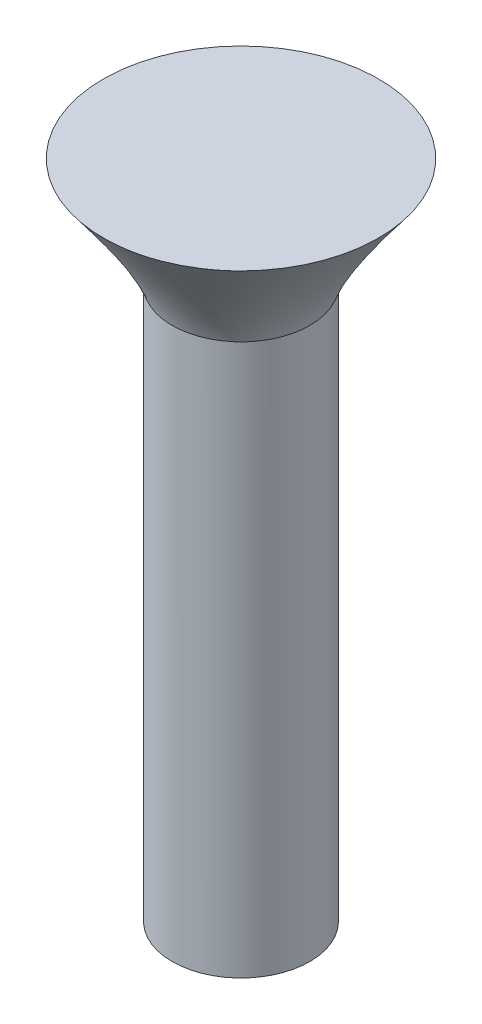
ISO-10303-21;
HEADER;
FILE_DESCRIPTION(('STEP AP214'),'2;1');
FILE_NAME('part.step','',(''),(''),'','','');
FILE_SCHEMA(('AUTOMOTIVE_DESIGN { 1 0 10303 214 1 1 1 1 }'));
ENDSEC;
DATA;
#1=APPLICATION_CONTEXT('core data for automotive mechanical design processes');
#2=APPLICATION_PROTOCOL_DEFINITION('international standard','automotive_design',2000,#1);
#3=PRODUCT_CONTEXT('',#1,'mechanical');
#4=PRODUCT('Part','Part','',(#3));
#5=PRODUCT_RELATED_PRODUCT_CATEGORY('part','',(#4));
#6=PRODUCT_DEFINITION_FORMATION('','',#4);
#7=PRODUCT_DEFINITION_CONTEXT('part definition',#1,'design');
#8=PRODUCT_DEFINITION('design','',#6,#7);
#9=PRODUCT_DEFINITION_SHAPE('','',#8);
#10=(LENGTH_UNIT() NAMED_UNIT(*) SI_UNIT(.MILLI.,.METRE.));
#11=(NAMED_UNIT(*) PLANE_ANGLE_UNIT() SI_UNIT($,.RADIAN.));
#12=(NAMED_UNIT(*) SI_UNIT($,.STERADIAN.) SOLID_ANGLE_UNIT());
#13=UNCERTAINTY_MEASURE_WITH_UNIT(LENGTH_MEASURE(1.E-05),#10,'distance_accuracy_value','');
#14=(GEOMETRIC_REPRESENTATION_CONTEXT(3) GLOBAL_UNCERTAINTY_ASSIGNED_CONTEXT((#13)) GLOBAL_UNIT_ASSIGNED_CONTEXT((#10,
#11,#12)) REPRESENTATION_CONTEXT('',''));
#15=CARTESIAN_POINT('',(0.,0.,0.));
#16=DIRECTION('',(0.,0.,1.));
#17=DIRECTION('',(1.,0.,0.));
#18=AXIS2_PLACEMENT_3D('',#15,#16,#17);
#19=CARTESIAN_POINT('',(0.,20.,0.));
#20=DIRECTION('',(0.,-1.,0.));
#21=DIRECTION('',(0.,0.,-1.));
#22=AXIS2_PLACEMENT_3D('',#19,#20,#21);
#23=CYLINDRICAL_SURFACE('',#22,2.5);
#24=CARTESIAN_POINT('',(0.,20.,0.));
#25=DIRECTION('',(0.,-1.,0.));
#26=DIRECTION('',(0.,0.,-1.));
#27=AXIS2_PLACEMENT_3D('',#24,#25,#26);
#28=CIRCLE('',#27,2.5);
#29=CARTESIAN_POINT('',(-2.27850819158861,20.,-1.02878589651277));
#30=VERTEX_POINT('',#29);
#31=EDGE_CURVE('E11',#30,#30,#28,.F.);
#32=ORIENTED_EDGE('',*,*,#31,.F.);
#33=EDGE_LOOP('',(#32));
#34=FACE_BOUND('',#33,.T.);
#35=CARTESIAN_POINT('',(0.,0.,0.));
#36=DIRECTION('',(0.,1.,0.));
#37=DIRECTION('',(0.,0.,1.));
#38=AXIS2_PLACEMENT_3D('',#35,#36,#37);
#39=CIRCLE('',#38,2.5);
#40=CARTESIAN_POINT('',(0.,0.,2.5));
#41=VERTEX_POINT('',#40);
#42=EDGE_CURVE('E45',#41,#41,#39,.T.);
#43=ORIENTED_EDGE('',*,*,#42,.T.);
#44=EDGE_LOOP('',(#43));
#45=FACE_BOUND('',#44,.T.);
#46=ADVANCED_FACE('F38',(#34,#45),#23,.T.);
#47=CARTESIAN_POINT('',(0.,0.,0.));
#48=DIRECTION('',(0.,1.,0.));
#49=DIRECTION('',(0.,0.,1.));
#50=AXIS2_PLACEMENT_3D('',#47,#48,#49);
#51=PLANE('',#50);
#52=ORIENTED_EDGE('',*,*,#42,.F.);
#53=EDGE_LOOP('',(#52));
#54=FACE_BOUND('',#53,.T.);
#55=ADVANCED_FACE('F71',(#54),#51,.F.);
#56=CARTESIAN_POINT('',(0.,24.000000128,0.));
#57=DIRECTION('',(0.,1.,0.));
#58=DIRECTION('',(0.,0.,1.));
#59=AXIS2_PLACEMENT_3D('',#56,#57,#58);
#60=PLANE('',#59);
#61=CARTESIAN_POINT('',(0.,24.000000128,0.));
#62=DIRECTION('',(0.,1.,0.));
#63=DIRECTION('',(0.,0.,1.));
#64=AXIS2_PLACEMENT_3D('',#61,#62,#63);
#65=CIRCLE('',#64,5.);
#66=CARTESIAN_POINT('',(-2.25314133065137,24.000000128,-4.46355846204691));
#67=VERTEX_POINT('',#66);
#68=EDGE_CURVE('E49',#67,#67,#65,.T.);
#69=ORIENTED_EDGE('',*,*,#68,.T.);
#70=EDGE_LOOP('',(#69));
#71=FACE_BOUND('',#70,.T.);
#72=ADVANCED_FACE('F61',(#71),#60,.T.);
#73=CARTESIAN_POINT('',(-2.27850819158861,20.,-1.02878589651277));
#74=CARTESIAN_POINT('',(-2.25314133065137,24.000000128,-4.46355846204691));
#75=CARTESIAN_POINT('',(-4.33607998461416,20.,3.52823048666445));
#76=CARTESIAN_POINT('',(-11.1802582547452,24.000000128,0.0427241992558202));
#77=CARTESIAN_POINT('',(0.220936398563068,20.,5.58580227969));
#78=CARTESIAN_POINT('',(-6.67397559344245,24.000000128,8.96984112334964));
#79=CARTESIAN_POINT('',(2.27850819158861,20.,1.02878589651277));
#80=CARTESIAN_POINT('',(2.25314133065137,24.000000128,4.46355846204691));
#81=CARTESIAN_POINT('',(4.33607998461416,20.,-3.52823048666445));
#82=CARTESIAN_POINT('',(11.1802582547452,24.000000128,-0.0427241992558211));
#83=CARTESIAN_POINT('',(-0.220936398563068,20.,-5.58580227969));
#84=CARTESIAN_POINT('',(6.67397559344246,24.000000128,-8.96984112334964));
#85=CARTESIAN_POINT('',(-2.27850819158861,20.,-1.02878589651277));
#86=CARTESIAN_POINT('',(-2.25314133065137,24.000000128,-4.46355846204691));
#87=(BOUNDED_SURFACE() B_SPLINE_SURFACE(3,1,((#73,#74),(#75,#76),(#77,#78),(#79,#80),(#81,#82),
(#83,#84),(#85,#86)),.UNSPECIFIED.,.T.,.F.,.F.) B_SPLINE_SURFACE_WITH_KNOTS((4,3,4),(2,2),(0.,
0.5,1.),(0.,1.),.UNSPECIFIED.) GEOMETRIC_REPRESENTATION_ITEM() RATIONAL_B_SPLINE_SURFACE(((1.,
1.),(0.333333333333333,0.333333333333333),(0.333333333333333,0.333333333333333),(1.,1.),
(0.333333333333333,0.333333333333333),(0.333333333333333,0.333333333333333),(1.,1.))) REPRESENTATION_ITEM('') SURFACE());
#88=CARTESIAN_POINT('',(-2.27850819158861,20.,-1.02878589651277));
#89=CARTESIAN_POINT('',(-2.27824395345385,20.041666668,-1.06456477740375));
#90=CARTESIAN_POINT('',(-2.27797971531909,20.083333336,-1.10034365829473));
#91=CARTESIAN_POINT('',(-2.27745123904956,20.166666672,-1.1719014200767));
#92=CARTESIAN_POINT('',(-2.2771870009148,20.20833334,-1.20768030096768));
#93=CARTESIAN_POINT('',(-2.27665852464527,20.291666676,-1.27923806274964));
#94=CARTESIAN_POINT('',(-2.27639428651051,20.333333344,-1.31501694364062));
#95=CARTESIAN_POINT('',(-2.27586581024098,20.41666668,-1.38657470542258));
#96=CARTESIAN_POINT('',(-2.27560157210622,20.458333348,-1.42235358631356));
#97=CARTESIAN_POINT('',(-2.27507309583669,20.541666684,-1.49391134809552));
#98=CARTESIAN_POINT('',(-2.27480885770193,20.583333352,-1.5296902289865));
#99=CARTESIAN_POINT('',(-2.27428038143241,20.666666688,-1.60124799076846));
#100=CARTESIAN_POINT('',(-2.27401614329764,20.708333356,-1.63702687165944));
#101=CARTESIAN_POINT('',(-2.27348766702812,20.791666692,-1.7085846334414));
#102=CARTESIAN_POINT('',(-2.27322342889335,20.83333336,-1.74436351433238));
#103=CARTESIAN_POINT('',(-2.27269495262383,20.916666696,-1.81592127611435));
#104=CARTESIAN_POINT('',(-2.27243071448906,20.958333364,-1.85170015700533));
#105=CARTESIAN_POINT('',(-2.27190223821954,21.0416667,-1.92325791878729));
#106=CARTESIAN_POINT('',(-2.27163800008478,21.083333368,-1.95903679967827));
#107=CARTESIAN_POINT('',(-2.27110952381525,21.166666704,-2.03059456146023));
#108=CARTESIAN_POINT('',(-2.27084528568049,21.208333372,-2.06637344235121));
#109=CARTESIAN_POINT('',(-2.27031680941096,21.291666708,-2.13793120413317));
#110=CARTESIAN_POINT('',(-2.2700525712762,21.333333376,-2.17371008502415));
#111=CARTESIAN_POINT('',(-2.26952409500667,21.416666712,-2.24526784680611));
#112=CARTESIAN_POINT('',(-2.26925985687191,21.45833338,-2.28104672769709));
#113=CARTESIAN_POINT('',(-2.26873138060238,21.541666716,-2.35260448947906));
#114=CARTESIAN_POINT('',(-2.26846714246762,21.583333384,-2.38838337037004));
#115=CARTESIAN_POINT('',(-2.26793866619809,21.66666672,-2.459941132152));
#116=CARTESIAN_POINT('',(-2.26767442806333,21.708333388,-2.49572001304298));
#117=CARTESIAN_POINT('',(-2.2671459517938,21.791666724,-2.56727777482494));
#118=CARTESIAN_POINT('',(-2.26688171365904,21.833333392,-2.60305665571592));
#119=CARTESIAN_POINT('',(-2.26635323738952,21.916666728,-2.67461441749788));
#120=CARTESIAN_POINT('',(-2.26608899925475,21.958333396,-2.71039329838886));
#121=CARTESIAN_POINT('',(-2.26556052298523,22.041666732,-2.78195106017082));
#122=CARTESIAN_POINT('',(-2.26529628485046,22.0833334,-2.8177299410618));
#123=CARTESIAN_POINT('',(-2.26476780858094,22.166666736,-2.88928770284376));
#124=CARTESIAN_POINT('',(-2.26450357044617,22.208333404,-2.92506658373475));
#125=CARTESIAN_POINT('',(-2.26397509417665,22.29166674,-2.99662434551671));
#126=CARTESIAN_POINT('',(-2.26371085604189,22.333333408,-3.03240322640769));
#127=CARTESIAN_POINT('',(-2.26318237977236,22.416666744,-3.10396098818965));
#128=CARTESIAN_POINT('',(-2.2629181416376,22.458333412,-3.13973986908063));
#129=CARTESIAN_POINT('',(-2.26238966536807,22.541666748,-3.21129763086259));
#130=CARTESIAN_POINT('',(-2.26212542723331,22.583333416,-3.24707651175357));
#131=CARTESIAN_POINT('',(-2.26159695096378,22.666666752,-3.31863427353553));
#132=CARTESIAN_POINT('',(-2.26133271282902,22.70833342,-3.35441315442651));
#133=CARTESIAN_POINT('',(-2.26080423655949,22.791666756,-3.42597091620847));
#134=CARTESIAN_POINT('',(-2.26053999842473,22.833333424,-3.46174979709946));
#135=CARTESIAN_POINT('',(-2.2600115221552,22.91666676,-3.53330755888142));
#136=CARTESIAN_POINT('',(-2.25974728402044,22.958333428,-3.5690864397724));
#137=CARTESIAN_POINT('',(-2.25921880775092,23.041666764,-3.64064420155436));
#138=CARTESIAN_POINT('',(-2.25895456961615,23.083333432,-3.67642308244534));
#139=CARTESIAN_POINT('',(-2.25842609334663,23.166666768,-3.7479808442273));
#140=CARTESIAN_POINT('',(-2.25816185521186,23.208333436,-3.78375972511828));
#141=CARTESIAN_POINT('',(-2.25763337894234,23.291666772,-3.85531748690024));
#142=CARTESIAN_POINT('',(-2.25736914080757,23.33333344,-3.89109636779122));
#143=CARTESIAN_POINT('',(-2.25684066453805,23.416666776,-3.96265412957318));
#144=CARTESIAN_POINT('',(-2.25657642640328,23.458333444,-3.99843301046416));
#145=CARTESIAN_POINT('',(-2.25604795013376,23.54166678,-4.06999077224613));
#146=CARTESIAN_POINT('',(-2.255783711999,23.583333448,-4.10576965313711));
#147=CARTESIAN_POINT('',(-2.25525523572947,23.666666784,-4.17732741491907));
#148=CARTESIAN_POINT('',(-2.25499099759471,23.708333452,-4.21310629581005));
#149=CARTESIAN_POINT('',(-2.25446252132518,23.791666788,-4.28466405759201));
#150=CARTESIAN_POINT('',(-2.25419828319042,23.833333456,-4.32044293848299));
#151=CARTESIAN_POINT('',(-2.25366980692089,23.916666792,-4.39200070026495));
#152=CARTESIAN_POINT('',(-2.25340556878613,23.95833346,-4.42777958115593));
#153=CARTESIAN_POINT('',(-2.25314133065137,24.000000128,-4.46355846204691));
#154=B_SPLINE_CURVE_WITH_KNOTS('',3,(#88,#89,#90,#91,#92,#93,#94,#95,#96,#97,#98,#99,#100,#101,
#102,#103,#104,#105,#106,#107,#108,#109,#110,#111,#112,#113,#114,#115,#116,#117,#118,#119,#120,
#121,#122,#123,#124,#125,#126,#127,#128,#129,#130,#131,#132,#133,#134,#135,#136,#137,#138,#139,
#140,#141,#142,#143,#144,#145,#146,#147,#148,#149,#150,#151,#152,#153),.UNSPECIFIED.,.F.,.F.,(4,
2,2,2,2,2,2,2,2,2,2,2,2,2,2,2,2,2,2,2,2,2,2,2,2,2,2,2,2,2,2,2,4),(0.,0.164762812116161,
0.329525624232324,0.494288436348484,0.659051248464647,0.823814060580807,0.98857687269697,
1.15333968481313,1.31810249692929,1.48286530904545,1.64762812116162,1.81239093327778,
1.97715374539394,2.1419165575101,2.30667936962626,2.47144218174242,2.63620499385858,
2.80096780597475,2.96573061809091,3.13049343020707,3.29525624232323,3.4600190544394,
3.62478186655556,3.78954467867172,3.95430749078788,4.11907030290404,4.2838331150202,
4.44859592713636,4.61335873925253,4.77812155136869,4.94288436348485,5.10764717560101,
5.27240998771717),.UNSPECIFIED.);
#155=EDGE_CURVE('BSEAM70',#30,#67,#154,.T.);
#156=ORIENTED_EDGE('',*,*,#31,.T.);
#157=ORIENTED_EDGE('',*,*,#68,.F.);
#158=ORIENTED_EDGE('',*,*,#155,.T.);
#159=ORIENTED_EDGE('',*,*,#155,.F.);
#160=EDGE_LOOP('',(#156,#158,#157,#159));
#161=FACE_BOUND('',#160,.T.);
#162=ADVANCED_FACE('F70',(#161),#87,.T.);
#163=CLOSED_SHELL('',(#46,#55,#72,#162));
#164=MANIFOLD_SOLID_BREP('B2',#163);
#165=ADVANCED_BREP_SHAPE_REPRESENTATION('',(#18,#164),#14);
#166=SHAPE_DEFINITION_REPRESENTATION(#9,#165);
ENDSEC;
END-ISO-10303-21;
